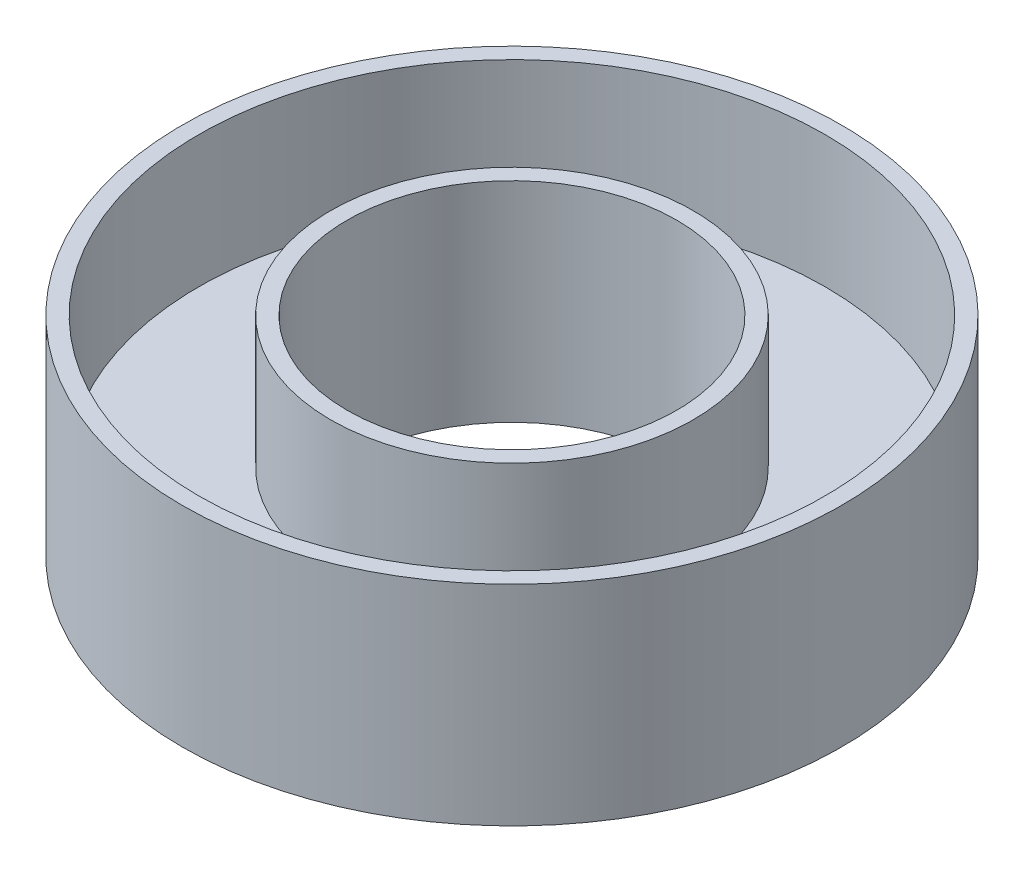
ISO-10303-21;
HEADER;
FILE_DESCRIPTION(('STEP AP214'),'2;1');
FILE_NAME('part.step','',(''),(''),'','','');
FILE_SCHEMA(('AUTOMOTIVE_DESIGN { 1 0 10303 214 1 1 1 1 }'));
ENDSEC;
DATA;
#1=APPLICATION_CONTEXT('core data for automotive mechanical design processes');
#2=APPLICATION_PROTOCOL_DEFINITION('international standard','automotive_design',2000,#1);
#3=PRODUCT_CONTEXT('',#1,'mechanical');
#4=PRODUCT('Part','Part','',(#3));
#5=PRODUCT_RELATED_PRODUCT_CATEGORY('part','',(#4));
#6=PRODUCT_DEFINITION_FORMATION('','',#4);
#7=PRODUCT_DEFINITION_CONTEXT('part definition',#1,'design');
#8=PRODUCT_DEFINITION('design','',#6,#7);
#9=PRODUCT_DEFINITION_SHAPE('','',#8);
#10=(LENGTH_UNIT() NAMED_UNIT(*) SI_UNIT(.MILLI.,.METRE.));
#11=(NAMED_UNIT(*) PLANE_ANGLE_UNIT() SI_UNIT($,.RADIAN.));
#12=(NAMED_UNIT(*) SI_UNIT($,.STERADIAN.) SOLID_ANGLE_UNIT());
#13=UNCERTAINTY_MEASURE_WITH_UNIT(LENGTH_MEASURE(1.E-05),#10,'distance_accuracy_value','');
#14=(GEOMETRIC_REPRESENTATION_CONTEXT(3) GLOBAL_UNCERTAINTY_ASSIGNED_CONTEXT((#13)) GLOBAL_UNIT_ASSIGNED_CONTEXT((#10,
#11,#12)) REPRESENTATION_CONTEXT('',''));
#15=CARTESIAN_POINT('',(0.,0.,0.));
#16=DIRECTION('',(0.,0.,1.));
#17=DIRECTION('',(1.,0.,0.));
#18=AXIS2_PLACEMENT_3D('',#15,#16,#17);
#19=CARTESIAN_POINT('',(0.,3.175,0.));
#20=DIRECTION('',(0.,1.,0.));
#21=DIRECTION('',(0.,0.,1.));
#22=AXIS2_PLACEMENT_3D('',#19,#20,#21);
#23=PLANE('',#22);
#24=CARTESIAN_POINT('',(0.,3.175,0.));
#25=DIRECTION('',(0.,1.,0.));
#26=DIRECTION('',(0.,0.,1.));
#27=AXIS2_PLACEMENT_3D('',#24,#25,#26);
#28=CIRCLE('',#27,2.5);
#29=CARTESIAN_POINT('',(0.,3.175,2.5));
#30=VERTEX_POINT('',#29);
#31=EDGE_CURVE('E56',#30,#30,#28,.T.);
#32=ORIENTED_EDGE('',*,*,#31,.F.);
#33=EDGE_LOOP('',(#32));
#34=FACE_BOUND('',#33,.T.);
#35=CARTESIAN_POINT('',(0.,3.175,0.));
#36=DIRECTION('',(0.,1.,0.));
#37=DIRECTION('',(0.,0.,1.));
#38=AXIS2_PLACEMENT_3D('',#35,#36,#37);
#39=CIRCLE('',#38,2.75);
#40=CARTESIAN_POINT('',(0.,3.175,2.75));
#41=VERTEX_POINT('',#40);
#42=EDGE_CURVE('E74',#41,#41,#39,.T.);
#43=ORIENTED_EDGE('',*,*,#42,.T.);
#44=EDGE_LOOP('',(#43));
#45=FACE_BOUND('',#44,.T.);
#46=ADVANCED_FACE('F43',(#34,#45),#23,.T.);
#47=CARTESIAN_POINT('',(0.,3.175,0.));
#48=DIRECTION('',(0.,1.,0.));
#49=DIRECTION('',(0.,0.,1.));
#50=AXIS2_PLACEMENT_3D('',#47,#48,#49);
#51=CIRCLE('',#50,4.75);
#52=CARTESIAN_POINT('',(0.,3.175,4.75));
#53=VERTEX_POINT('',#52);
#54=EDGE_CURVE('E66',#53,#53,#51,.T.);
#55=ORIENTED_EDGE('',*,*,#54,.F.);
#56=EDGE_LOOP('',(#55));
#57=FACE_BOUND('',#56,.T.);
#58=CARTESIAN_POINT('',(0.,3.175,0.));
#59=DIRECTION('',(0.,1.,0.));
#60=DIRECTION('',(0.,0.,1.));
#61=AXIS2_PLACEMENT_3D('',#58,#59,#60);
#62=CIRCLE('',#61,5.);
#63=CARTESIAN_POINT('',(0.,3.175,5.));
#64=VERTEX_POINT('',#63);
#65=EDGE_CURVE('E10',#64,#64,#62,.T.);
#66=ORIENTED_EDGE('',*,*,#65,.T.);
#67=EDGE_LOOP('',(#66));
#68=FACE_BOUND('',#67,.T.);
#69=ADVANCED_FACE('F98',(#57,#68),#23,.T.);
#70=CARTESIAN_POINT('',(0.,0.,0.));
#71=DIRECTION('',(0.,1.,0.));
#72=DIRECTION('',(0.,0.,1.));
#73=AXIS2_PLACEMENT_3D('',#70,#71,#72);
#74=PLANE('',#73);
#75=CARTESIAN_POINT('',(0.,0.,0.));
#76=DIRECTION('',(0.,1.,0.));
#77=DIRECTION('',(0.,0.,1.));
#78=AXIS2_PLACEMENT_3D('',#75,#76,#77);
#79=CIRCLE('',#78,5.);
#80=CARTESIAN_POINT('',(0.,0.,5.));
#81=VERTEX_POINT('',#80);
#82=EDGE_CURVE('E47',#81,#81,#79,.T.);
#83=ORIENTED_EDGE('',*,*,#82,.F.);
#84=EDGE_LOOP('',(#83));
#85=FACE_BOUND('',#84,.T.);
#86=CARTESIAN_POINT('',(0.,0.,0.));
#87=DIRECTION('',(0.,1.,0.));
#88=DIRECTION('',(0.,0.,1.));
#89=AXIS2_PLACEMENT_3D('',#86,#87,#88);
#90=CIRCLE('',#89,2.5);
#91=CARTESIAN_POINT('',(0.,0.,2.5));
#92=VERTEX_POINT('',#91);
#93=EDGE_CURVE('E58',#92,#92,#90,.T.);
#94=ORIENTED_EDGE('',*,*,#93,.T.);
#95=EDGE_LOOP('',(#94));
#96=FACE_BOUND('',#95,.T.);
#97=ADVANCED_FACE('F100',(#85,#96),#74,.F.);
#98=CARTESIAN_POINT('',(0.,3.175,0.));
#99=DIRECTION('',(0.,-1.,0.));
#100=DIRECTION('',(0.,0.,-1.));
#101=AXIS2_PLACEMENT_3D('',#98,#99,#100);
#102=CYLINDRICAL_SURFACE('',#101,5.);
#103=ORIENTED_EDGE('',*,*,#65,.F.);
#104=EDGE_LOOP('',(#103));
#105=FACE_BOUND('',#104,.T.);
#106=ORIENTED_EDGE('',*,*,#82,.T.);
#107=EDGE_LOOP('',(#106));
#108=FACE_BOUND('',#107,.T.);
#109=ADVANCED_FACE('F45',(#105,#108),#102,.T.);
#110=CARTESIAN_POINT('',(0.,3.175,0.));
#111=DIRECTION('',(0.,-1.,0.));
#112=DIRECTION('',(0.,0.,-1.));
#113=AXIS2_PLACEMENT_3D('',#110,#111,#112);
#114=CYLINDRICAL_SURFACE('',#113,2.5);
#115=ORIENTED_EDGE('',*,*,#31,.T.);
#116=EDGE_LOOP('',(#115));
#117=FACE_BOUND('',#116,.T.);
#118=ORIENTED_EDGE('',*,*,#93,.F.);
#119=EDGE_LOOP('',(#118));
#120=FACE_BOUND('',#119,.T.);
#121=ADVANCED_FACE('F94',(#117,#120),#114,.F.);
#122=CARTESIAN_POINT('',(0.,1.175,0.));
#123=DIRECTION('',(0.,1.,0.));
#124=DIRECTION('',(0.,0.,1.));
#125=AXIS2_PLACEMENT_3D('',#122,#123,#124);
#126=CYLINDRICAL_SURFACE('',#125,4.75);
#127=CARTESIAN_POINT('',(0.,1.175,0.));
#128=DIRECTION('',(0.,1.,0.));
#129=DIRECTION('',(0.,0.,1.));
#130=AXIS2_PLACEMENT_3D('',#127,#128,#129);
#131=CIRCLE('',#130,4.75);
#132=CARTESIAN_POINT('',(0.,1.175,4.75));
#133=VERTEX_POINT('',#132);
#134=EDGE_CURVE('E62',#133,#133,#131,.T.);
#135=ORIENTED_EDGE('',*,*,#134,.F.);
#136=EDGE_LOOP('',(#135));
#137=FACE_BOUND('',#136,.T.);
#138=ORIENTED_EDGE('',*,*,#54,.T.);
#139=EDGE_LOOP('',(#138));
#140=FACE_BOUND('',#139,.T.);
#141=ADVANCED_FACE('F88',(#137,#140),#126,.F.);
#142=CARTESIAN_POINT('',(0.,1.175,0.));
#143=DIRECTION('',(0.,1.,0.));
#144=DIRECTION('',(0.,0.,1.));
#145=AXIS2_PLACEMENT_3D('',#142,#143,#144);
#146=PLANE('',#145);
#147=CARTESIAN_POINT('',(0.,1.175,0.));
#148=DIRECTION('',(0.,1.,0.));
#149=DIRECTION('',(0.,0.,1.));
#150=AXIS2_PLACEMENT_3D('',#147,#148,#149);
#151=CIRCLE('',#150,2.75);
#152=CARTESIAN_POINT('',(0.,1.175,2.75));
#153=VERTEX_POINT('',#152);
#154=EDGE_CURVE('E70',#153,#153,#151,.T.);
#155=ORIENTED_EDGE('',*,*,#154,.F.);
#156=EDGE_LOOP('',(#155));
#157=FACE_BOUND('',#156,.T.);
#158=ORIENTED_EDGE('',*,*,#134,.T.);
#159=EDGE_LOOP('',(#158));
#160=FACE_BOUND('',#159,.T.);
#161=ADVANCED_FACE('F85',(#157,#160),#146,.T.);
#162=CARTESIAN_POINT('',(0.,1.175,0.));
#163=DIRECTION('',(0.,1.,0.));
#164=DIRECTION('',(0.,0.,1.));
#165=AXIS2_PLACEMENT_3D('',#162,#163,#164);
#166=CYLINDRICAL_SURFACE('',#165,2.75);
#167=ORIENTED_EDGE('',*,*,#154,.T.);
#168=EDGE_LOOP('',(#167));
#169=FACE_BOUND('',#168,.T.);
#170=ORIENTED_EDGE('',*,*,#42,.F.);
#171=EDGE_LOOP('',(#170));
#172=FACE_BOUND('',#171,.T.);
#173=ADVANCED_FACE('F82',(#169,#172),#166,.T.);
#174=CLOSED_SHELL('',(#46,#69,#97,#109,#121,#141,#161,#173));
#175=MANIFOLD_SOLID_BREP('B2',#174);
#176=ADVANCED_BREP_SHAPE_REPRESENTATION('',(#18,#175),#14);
#177=SHAPE_DEFINITION_REPRESENTATION(#9,#176);
ENDSEC;
END-ISO-10303-21;
